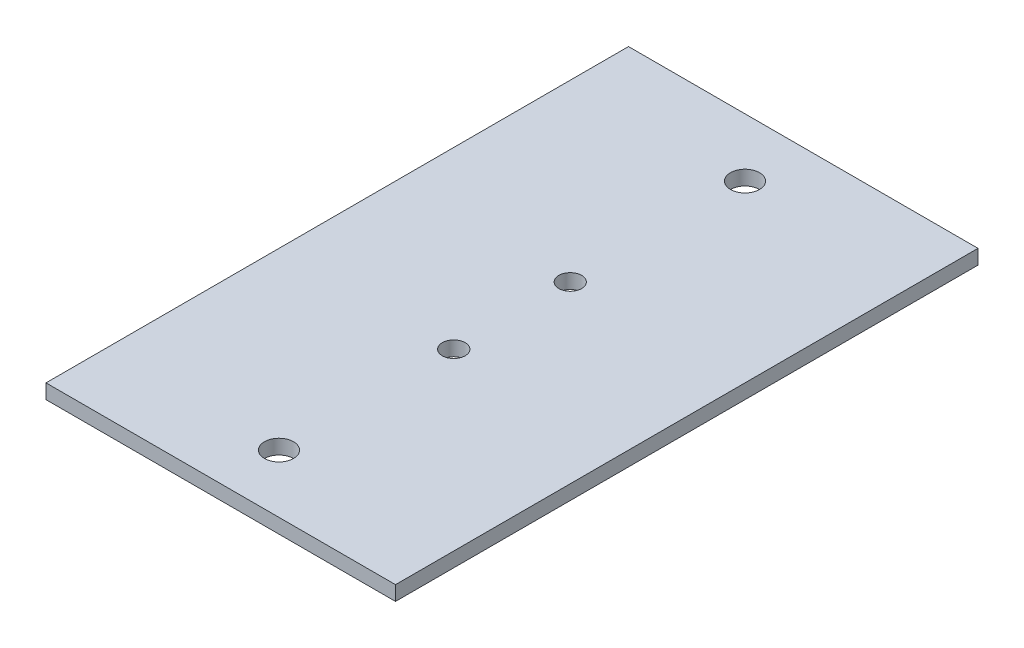
ISO-10303-21;
HEADER;
FILE_DESCRIPTION(('STEP AP214'),'2;1');
FILE_NAME('part.step','',(''),(''),'','','');
FILE_SCHEMA(('AUTOMOTIVE_DESIGN { 1 0 10303 214 1 1 1 1 }'));
ENDSEC;
DATA;
#1=APPLICATION_CONTEXT('core data for automotive mechanical design processes');
#2=APPLICATION_PROTOCOL_DEFINITION('international standard','automotive_design',2000,#1);
#3=PRODUCT_CONTEXT('',#1,'mechanical');
#4=PRODUCT('Part','Part','',(#3));
#5=PRODUCT_RELATED_PRODUCT_CATEGORY('part','',(#4));
#6=PRODUCT_DEFINITION_FORMATION('','',#4);
#7=PRODUCT_DEFINITION_CONTEXT('part definition',#1,'design');
#8=PRODUCT_DEFINITION('design','',#6,#7);
#9=PRODUCT_DEFINITION_SHAPE('','',#8);
#10=(LENGTH_UNIT() NAMED_UNIT(*) SI_UNIT(.MILLI.,.METRE.));
#11=(NAMED_UNIT(*) PLANE_ANGLE_UNIT() SI_UNIT($,.RADIAN.));
#12=(NAMED_UNIT(*) SI_UNIT($,.STERADIAN.) SOLID_ANGLE_UNIT());
#13=UNCERTAINTY_MEASURE_WITH_UNIT(LENGTH_MEASURE(1.E-05),#10,'distance_accuracy_value','');
#14=(GEOMETRIC_REPRESENTATION_CONTEXT(3) GLOBAL_UNCERTAINTY_ASSIGNED_CONTEXT((#13)) GLOBAL_UNIT_ASSIGNED_CONTEXT((#10,
#11,#12)) REPRESENTATION_CONTEXT('',''));
#15=CARTESIAN_POINT('',(0.,0.,0.));
#16=DIRECTION('',(0.,0.,1.));
#17=DIRECTION('',(1.,0.,0.));
#18=AXIS2_PLACEMENT_3D('',#15,#16,#17);
#19=CARTESIAN_POINT('',(0.,-3.175,127.));
#20=DIRECTION('',(0.,1.,0.));
#21=DIRECTION('',(0.,0.,1.));
#22=AXIS2_PLACEMENT_3D('',#19,#20,#21);
#23=PLANE('',#22);
#24=CARTESIAN_POINT('',(38.1,-3.175,12.7));
#25=DIRECTION('',(0.,1.,0.));
#26=DIRECTION('',(0.,0.,1.));
#27=AXIS2_PLACEMENT_3D('',#24,#25,#26);
#28=CIRCLE('',#27,3.175);
#29=CARTESIAN_POINT('',(38.1,-3.175,15.875));
#30=VERTEX_POINT('',#29);
#31=EDGE_CURVE('E108',#30,#30,#28,.T.);
#32=ORIENTED_EDGE('',*,*,#31,.T.);
#33=EDGE_LOOP('',(#32));
#34=FACE_BOUND('',#33,.T.);
#35=CARTESIAN_POINT('',(38.1,-3.175,50.8));
#36=DIRECTION('',(0.,1.,0.));
#37=DIRECTION('',(0.,0.,1.));
#38=AXIS2_PLACEMENT_3D('',#35,#36,#37);
#39=CIRCLE('',#38,2.4892);
#40=CARTESIAN_POINT('',(38.1,-3.175,53.2892));
#41=VERTEX_POINT('',#40);
#42=EDGE_CURVE('E144',#41,#41,#39,.T.);
#43=ORIENTED_EDGE('',*,*,#42,.T.);
#44=EDGE_LOOP('',(#43));
#45=FACE_BOUND('',#44,.T.);
#46=CARTESIAN_POINT('',(38.1,-3.175,76.2));
#47=DIRECTION('',(0.,1.,0.));
#48=DIRECTION('',(0.,0.,1.));
#49=AXIS2_PLACEMENT_3D('',#46,#47,#48);
#50=CIRCLE('',#49,2.4892);
#51=CARTESIAN_POINT('',(38.1,-3.175,78.6892));
#52=VERTEX_POINT('',#51);
#53=EDGE_CURVE('E136',#52,#52,#50,.T.);
#54=ORIENTED_EDGE('',*,*,#53,.T.);
#55=EDGE_LOOP('',(#54));
#56=FACE_BOUND('',#55,.T.);
#57=CARTESIAN_POINT('',(38.1,-3.175,114.3));
#58=DIRECTION('',(0.,1.,0.));
#59=DIRECTION('',(0.,0.,1.));
#60=AXIS2_PLACEMENT_3D('',#57,#58,#59);
#61=CIRCLE('',#60,3.175);
#62=CARTESIAN_POINT('',(38.1,-3.175,117.475));
#63=VERTEX_POINT('',#62);
#64=EDGE_CURVE('E128',#63,#63,#61,.T.);
#65=ORIENTED_EDGE('',*,*,#64,.T.);
#66=EDGE_LOOP('',(#65));
#67=FACE_BOUND('',#66,.T.);
#68=DIRECTION('',(1.,0.,0.));
#69=VECTOR('',#68,1.);
#70=CARTESIAN_POINT('',(0.,-3.175,0.));
#71=LINE('',#70,#69);
#72=CARTESIAN_POINT('',(0.,-3.175,0.));
#73=VERTEX_POINT('',#72);
#74=CARTESIAN_POINT('',(76.2,-3.175,0.));
#75=VERTEX_POINT('',#74);
#76=EDGE_CURVE('E105',#73,#75,#71,.T.);
#77=ORIENTED_EDGE('',*,*,#76,.T.);
#78=DIRECTION('',(0.,0.,-1.));
#79=VECTOR('',#78,1.);
#80=CARTESIAN_POINT('',(76.2,-3.175,127.));
#81=LINE('',#80,#79);
#82=CARTESIAN_POINT('',(76.2,-3.175,127.));
#83=VERTEX_POINT('',#82);
#84=EDGE_CURVE('E11',#83,#75,#81,.T.);
#85=ORIENTED_EDGE('',*,*,#84,.F.);
#86=DIRECTION('',(1.,0.,0.));
#87=VECTOR('',#86,1.);
#88=CARTESIAN_POINT('',(0.,-3.175,127.));
#89=LINE('',#88,#87);
#90=CARTESIAN_POINT('',(0.,-3.175,127.));
#91=VERTEX_POINT('',#90);
#92=EDGE_CURVE('E78',#91,#83,#89,.T.);
#93=ORIENTED_EDGE('',*,*,#92,.F.);
#94=DIRECTION('',(0.,0.,-1.));
#95=VECTOR('',#94,1.);
#96=CARTESIAN_POINT('',(0.,-3.175,127.));
#97=LINE('',#96,#95);
#98=EDGE_CURVE('E54',#91,#73,#97,.T.);
#99=ORIENTED_EDGE('',*,*,#98,.T.);
#100=EDGE_LOOP('',(#77,#85,#93,#99));
#101=FACE_BOUND('',#100,.T.);
#102=ADVANCED_FACE('F37',(#34,#45,#56,#67,#101),#23,.F.);
#103=CARTESIAN_POINT('',(76.2,0.,127.));
#104=DIRECTION('',(1.,0.,0.));
#105=DIRECTION('',(0.,0.,-1.));
#106=AXIS2_PLACEMENT_3D('',#103,#104,#105);
#107=PLANE('',#106);
#108=DIRECTION('',(0.,-1.,0.));
#109=VECTOR('',#108,1.);
#110=CARTESIAN_POINT('',(76.2,0.,0.));
#111=LINE('',#110,#109);
#112=CARTESIAN_POINT('',(76.2,0.,0.));
#113=VERTEX_POINT('',#112);
#114=EDGE_CURVE('E87',#113,#75,#111,.T.);
#115=ORIENTED_EDGE('',*,*,#114,.F.);
#116=DIRECTION('',(0.,0.,-1.));
#117=VECTOR('',#116,1.);
#118=CARTESIAN_POINT('',(76.2,0.,127.));
#119=LINE('',#118,#117);
#120=CARTESIAN_POINT('',(76.2,0.,127.));
#121=VERTEX_POINT('',#120);
#122=EDGE_CURVE('E46',#121,#113,#119,.T.);
#123=ORIENTED_EDGE('',*,*,#122,.F.);
#124=DIRECTION('',(0.,-1.,0.));
#125=VECTOR('',#124,1.);
#126=CARTESIAN_POINT('',(76.2,0.,127.));
#127=LINE('',#126,#125);
#128=EDGE_CURVE('E85',#121,#83,#127,.T.);
#129=ORIENTED_EDGE('',*,*,#128,.T.);
#130=ORIENTED_EDGE('',*,*,#84,.T.);
#131=EDGE_LOOP('',(#115,#123,#129,#130));
#132=FACE_BOUND('',#131,.T.);
#133=ADVANCED_FACE('F84',(#132),#107,.T.);
#134=CARTESIAN_POINT('',(0.,0.,127.));
#135=DIRECTION('',(0.,1.,0.));
#136=DIRECTION('',(0.,0.,1.));
#137=AXIS2_PLACEMENT_3D('',#134,#135,#136);
#138=PLANE('',#137);
#139=CARTESIAN_POINT('',(38.1,0.,12.7));
#140=DIRECTION('',(0.,1.,0.));
#141=DIRECTION('',(0.,0.,1.));
#142=AXIS2_PLACEMENT_3D('',#139,#140,#141);
#143=CIRCLE('',#142,3.175);
#144=CARTESIAN_POINT('',(38.1,0.,15.875));
#145=VERTEX_POINT('',#144);
#146=EDGE_CURVE('E148',#145,#145,#143,.T.);
#147=ORIENTED_EDGE('',*,*,#146,.F.);
#148=EDGE_LOOP('',(#147));
#149=FACE_BOUND('',#148,.T.);
#150=CARTESIAN_POINT('',(38.1,0.,50.8));
#151=DIRECTION('',(0.,1.,0.));
#152=DIRECTION('',(0.,0.,1.));
#153=AXIS2_PLACEMENT_3D('',#150,#151,#152);
#154=CIRCLE('',#153,2.4892);
#155=CARTESIAN_POINT('',(38.1,0.,53.2892));
#156=VERTEX_POINT('',#155);
#157=EDGE_CURVE('E140',#156,#156,#154,.T.);
#158=ORIENTED_EDGE('',*,*,#157,.F.);
#159=EDGE_LOOP('',(#158));
#160=FACE_BOUND('',#159,.T.);
#161=CARTESIAN_POINT('',(38.1,0.,76.2));
#162=DIRECTION('',(0.,1.,0.));
#163=DIRECTION('',(0.,0.,1.));
#164=AXIS2_PLACEMENT_3D('',#161,#162,#163);
#165=CIRCLE('',#164,2.4892);
#166=CARTESIAN_POINT('',(38.1,0.,78.6892));
#167=VERTEX_POINT('',#166);
#168=EDGE_CURVE('E132',#167,#167,#165,.T.);
#169=ORIENTED_EDGE('',*,*,#168,.F.);
#170=EDGE_LOOP('',(#169));
#171=FACE_BOUND('',#170,.T.);
#172=CARTESIAN_POINT('',(38.1,0.,114.3));
#173=DIRECTION('',(0.,1.,0.));
#174=DIRECTION('',(0.,0.,1.));
#175=AXIS2_PLACEMENT_3D('',#172,#173,#174);
#176=CIRCLE('',#175,3.175);
#177=CARTESIAN_POINT('',(38.1,0.,117.475));
#178=VERTEX_POINT('',#177);
#179=EDGE_CURVE('E124',#178,#178,#176,.T.);
#180=ORIENTED_EDGE('',*,*,#179,.F.);
#181=EDGE_LOOP('',(#180));
#182=FACE_BOUND('',#181,.T.);
#183=DIRECTION('',(1.,0.,0.));
#184=VECTOR('',#183,1.);
#185=CARTESIAN_POINT('',(0.,0.,0.));
#186=LINE('',#185,#184);
#187=CARTESIAN_POINT('',(0.,0.,0.));
#188=VERTEX_POINT('',#187);
#189=EDGE_CURVE('E111',#188,#113,#186,.T.);
#190=ORIENTED_EDGE('',*,*,#189,.F.);
#191=DIRECTION('',(0.,0.,-1.));
#192=VECTOR('',#191,1.);
#193=CARTESIAN_POINT('',(0.,0.,127.));
#194=LINE('',#193,#192);
#195=CARTESIAN_POINT('',(0.,0.,127.));
#196=VERTEX_POINT('',#195);
#197=EDGE_CURVE('E67',#196,#188,#194,.T.);
#198=ORIENTED_EDGE('',*,*,#197,.F.);
#199=DIRECTION('',(1.,0.,0.));
#200=VECTOR('',#199,1.);
#201=CARTESIAN_POINT('',(0.,0.,127.));
#202=LINE('',#201,#200);
#203=EDGE_CURVE('E94',#196,#121,#202,.T.);
#204=ORIENTED_EDGE('',*,*,#203,.T.);
#205=ORIENTED_EDGE('',*,*,#122,.T.);
#206=EDGE_LOOP('',(#190,#198,#204,#205));
#207=FACE_BOUND('',#206,.T.);
#208=ADVANCED_FACE('F97',(#149,#160,#171,#182,#207),#138,.T.);
#209=CARTESIAN_POINT('',(0.,-3.175,127.));
#210=DIRECTION('',(-1.,0.,0.));
#211=DIRECTION('',(0.,0.,1.));
#212=AXIS2_PLACEMENT_3D('',#209,#210,#211);
#213=PLANE('',#212);
#214=DIRECTION('',(0.,1.,0.));
#215=VECTOR('',#214,1.);
#216=CARTESIAN_POINT('',(0.,-3.175,0.));
#217=LINE('',#216,#215);
#218=EDGE_CURVE('E114',#73,#188,#217,.T.);
#219=ORIENTED_EDGE('',*,*,#218,.F.);
#220=ORIENTED_EDGE('',*,*,#98,.F.);
#221=DIRECTION('',(0.,1.,0.));
#222=VECTOR('',#221,1.);
#223=CARTESIAN_POINT('',(0.,-3.175,127.));
#224=LINE('',#223,#222);
#225=EDGE_CURVE('E99',#91,#196,#224,.T.);
#226=ORIENTED_EDGE('',*,*,#225,.T.);
#227=ORIENTED_EDGE('',*,*,#197,.T.);
#228=EDGE_LOOP('',(#219,#220,#226,#227));
#229=FACE_BOUND('',#228,.T.);
#230=ADVANCED_FACE('F167',(#229),#213,.T.);
#231=CARTESIAN_POINT('',(0.,0.,127.));
#232=DIRECTION('',(0.,0.,-1.));
#233=DIRECTION('',(-1.,0.,0.));
#234=AXIS2_PLACEMENT_3D('',#231,#232,#233);
#235=PLANE('',#234);
#236=ORIENTED_EDGE('',*,*,#92,.T.);
#237=ORIENTED_EDGE('',*,*,#128,.F.);
#238=ORIENTED_EDGE('',*,*,#203,.F.);
#239=ORIENTED_EDGE('',*,*,#225,.F.);
#240=EDGE_LOOP('',(#236,#237,#238,#239));
#241=FACE_BOUND('',#240,.T.);
#242=ADVANCED_FACE('F93',(#241),#235,.F.);
#243=CARTESIAN_POINT('',(0.,0.,0.));
#244=DIRECTION('',(0.,0.,-1.));
#245=DIRECTION('',(-1.,0.,0.));
#246=AXIS2_PLACEMENT_3D('',#243,#244,#245);
#247=PLANE('',#246);
#248=ORIENTED_EDGE('',*,*,#76,.F.);
#249=ORIENTED_EDGE('',*,*,#218,.T.);
#250=ORIENTED_EDGE('',*,*,#189,.T.);
#251=ORIENTED_EDGE('',*,*,#114,.T.);
#252=EDGE_LOOP('',(#248,#249,#250,#251));
#253=FACE_BOUND('',#252,.T.);
#254=ADVANCED_FACE('F178',(#253),#247,.T.);
#255=CARTESIAN_POINT('',(38.1,-3.175,114.3));
#256=DIRECTION('',(0.,1.,0.));
#257=DIRECTION('',(0.,0.,1.));
#258=AXIS2_PLACEMENT_3D('',#255,#256,#257);
#259=CYLINDRICAL_SURFACE('',#258,3.175);
#260=ORIENTED_EDGE('',*,*,#64,.F.);
#261=EDGE_LOOP('',(#260));
#262=FACE_BOUND('',#261,.T.);
#263=ORIENTED_EDGE('',*,*,#179,.T.);
#264=EDGE_LOOP('',(#263));
#265=FACE_BOUND('',#264,.T.);
#266=ADVANCED_FACE('F175',(#262,#265),#259,.F.);
#267=CARTESIAN_POINT('',(38.1,-3.175,76.2));
#268=DIRECTION('',(0.,1.,0.));
#269=DIRECTION('',(0.,0.,1.));
#270=AXIS2_PLACEMENT_3D('',#267,#268,#269);
#271=CYLINDRICAL_SURFACE('',#270,2.4892);
#272=ORIENTED_EDGE('',*,*,#53,.F.);
#273=EDGE_LOOP('',(#272));
#274=FACE_BOUND('',#273,.T.);
#275=ORIENTED_EDGE('',*,*,#168,.T.);
#276=EDGE_LOOP('',(#275));
#277=FACE_BOUND('',#276,.T.);
#278=ADVANCED_FACE('F177',(#274,#277),#271,.F.);
#279=CARTESIAN_POINT('',(38.1,-3.175,50.8));
#280=DIRECTION('',(0.,1.,0.));
#281=DIRECTION('',(0.,0.,1.));
#282=AXIS2_PLACEMENT_3D('',#279,#280,#281);
#283=CYLINDRICAL_SURFACE('',#282,2.4892);
#284=ORIENTED_EDGE('',*,*,#42,.F.);
#285=EDGE_LOOP('',(#284));
#286=FACE_BOUND('',#285,.T.);
#287=ORIENTED_EDGE('',*,*,#157,.T.);
#288=EDGE_LOOP('',(#287));
#289=FACE_BOUND('',#288,.T.);
#290=ADVANCED_FACE('F161',(#286,#289),#283,.F.);
#291=CARTESIAN_POINT('',(38.1,-3.175,12.7));
#292=DIRECTION('',(0.,1.,0.));
#293=DIRECTION('',(0.,0.,1.));
#294=AXIS2_PLACEMENT_3D('',#291,#292,#293);
#295=CYLINDRICAL_SURFACE('',#294,3.175);
#296=ORIENTED_EDGE('',*,*,#31,.F.);
#297=EDGE_LOOP('',(#296));
#298=FACE_BOUND('',#297,.T.);
#299=ORIENTED_EDGE('',*,*,#146,.T.);
#300=EDGE_LOOP('',(#299));
#301=FACE_BOUND('',#300,.T.);
#302=ADVANCED_FACE('F158',(#298,#301),#295,.F.);
#303=CLOSED_SHELL('',(#102,#133,#208,#230,#242,#254,#266,#278,#290,#302));
#304=MANIFOLD_SOLID_BREP('B2',#303);
#305=ADVANCED_BREP_SHAPE_REPRESENTATION('',(#18,#304),#14);
#306=SHAPE_DEFINITION_REPRESENTATION(#9,#305);
ENDSEC;
END-ISO-10303-21;
